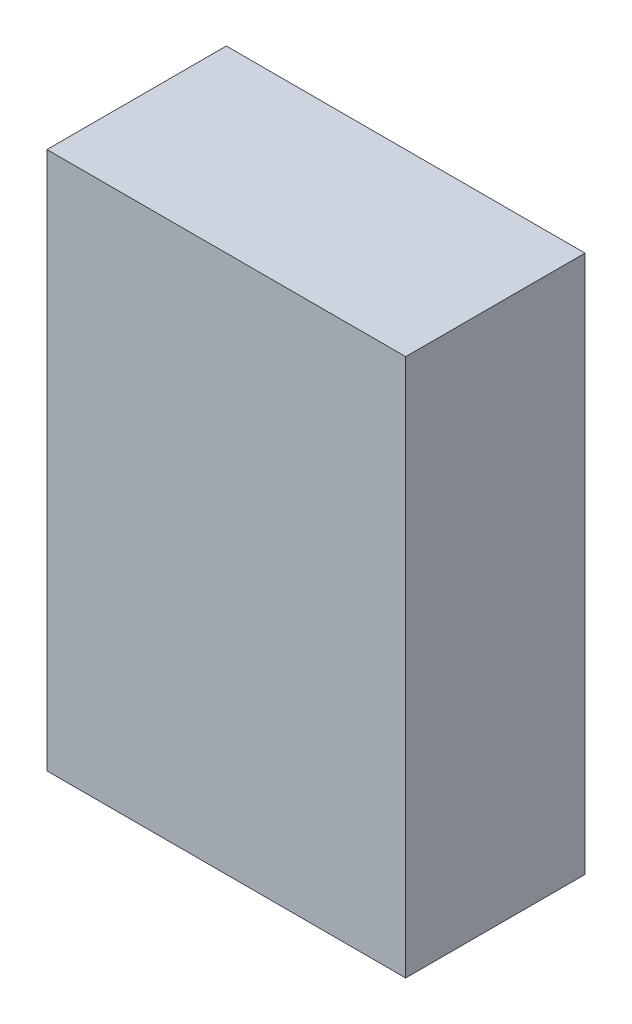
ISO-10303-21;
HEADER;
FILE_DESCRIPTION(('STEP AP214'),'2;1');
FILE_NAME('part.step','',(''),(''),'','','');
FILE_SCHEMA(('AUTOMOTIVE_DESIGN { 1 0 10303 214 1 1 1 1 }'));
ENDSEC;
DATA;
#1=APPLICATION_CONTEXT('core data for automotive mechanical design processes');
#2=APPLICATION_PROTOCOL_DEFINITION('international standard','automotive_design',2000,#1);
#3=PRODUCT_CONTEXT('',#1,'mechanical');
#4=PRODUCT('Part','Part','',(#3));
#5=PRODUCT_RELATED_PRODUCT_CATEGORY('part','',(#4));
#6=PRODUCT_DEFINITION_FORMATION('','',#4);
#7=PRODUCT_DEFINITION_CONTEXT('part definition',#1,'design');
#8=PRODUCT_DEFINITION('design','',#6,#7);
#9=PRODUCT_DEFINITION_SHAPE('','',#8);
#10=(LENGTH_UNIT() NAMED_UNIT(*) SI_UNIT(.MILLI.,.METRE.));
#11=(NAMED_UNIT(*) PLANE_ANGLE_UNIT() SI_UNIT($,.RADIAN.));
#12=(NAMED_UNIT(*) SI_UNIT($,.STERADIAN.) SOLID_ANGLE_UNIT());
#13=UNCERTAINTY_MEASURE_WITH_UNIT(LENGTH_MEASURE(1.E-05),#10,'distance_accuracy_value','');
#14=(GEOMETRIC_REPRESENTATION_CONTEXT(3) GLOBAL_UNCERTAINTY_ASSIGNED_CONTEXT((#13)) GLOBAL_UNIT_ASSIGNED_CONTEXT((#10,
#11,#12)) REPRESENTATION_CONTEXT('',''));
#15=CARTESIAN_POINT('',(0.,0.,0.));
#16=DIRECTION('',(0.,0.,1.));
#17=DIRECTION('',(1.,0.,0.));
#18=AXIS2_PLACEMENT_3D('',#15,#16,#17);
#19=CARTESIAN_POINT('',(-4.20452074349104,9.92882539662953,-2.12));
#20=DIRECTION('',(0.,-1.,0.));
#21=DIRECTION('',(0.,0.,-1.));
#22=AXIS2_PLACEMENT_3D('',#19,#20,#21);
#23=PLANE('',#22);
#24=DIRECTION('',(1.,0.,0.));
#25=VECTOR('',#24,1.);
#26=CARTESIAN_POINT('',(-6.20452074349104,9.92882539662953,-2.12));
#27=LINE('',#26,#25);
#28=CARTESIAN_POINT('',(-6.20452074349104,9.92882539662953,-2.12));
#29=VERTEX_POINT('',#28);
#30=CARTESIAN_POINT('',(-4.20452074349104,9.92882539662953,-2.12));
#31=VERTEX_POINT('',#30);
#32=EDGE_CURVE('E26',#29,#31,#27,.T.);
#33=ORIENTED_EDGE('',*,*,#32,.F.);
#34=DIRECTION('',(0.,0.,-1.));
#35=VECTOR('',#34,1.);
#36=CARTESIAN_POINT('',(-6.20452074349104,9.92882539662953,-2.12));
#37=LINE('',#36,#35);
#38=CARTESIAN_POINT('',(-6.20452074349104,9.92882539662953,-3.12));
#39=VERTEX_POINT('',#38);
#40=EDGE_CURVE('E11',#29,#39,#37,.T.);
#41=ORIENTED_EDGE('',*,*,#40,.T.);
#42=DIRECTION('',(-1.,0.,0.));
#43=VECTOR('',#42,1.);
#44=CARTESIAN_POINT('',(-6.20452074349104,9.92882539662953,-3.12));
#45=LINE('',#44,#43);
#46=CARTESIAN_POINT('',(-4.20452074349104,9.92882539662953,-3.12));
#47=VERTEX_POINT('',#46);
#48=EDGE_CURVE('E107',#47,#39,#45,.T.);
#49=ORIENTED_EDGE('',*,*,#48,.F.);
#50=DIRECTION('',(0.,0.,-1.));
#51=VECTOR('',#50,1.);
#52=CARTESIAN_POINT('',(-4.20452074349104,9.92882539662953,-2.12));
#53=LINE('',#52,#51);
#54=EDGE_CURVE('E101',#31,#47,#53,.T.);
#55=ORIENTED_EDGE('',*,*,#54,.F.);
#56=EDGE_LOOP('',(#33,#41,#49,#55));
#57=FACE_BOUND('',#56,.T.);
#58=ADVANCED_FACE('F16',(#57),#23,.T.);
#59=CARTESIAN_POINT('',(-6.20452074349104,9.92882539662953,-2.12));
#60=DIRECTION('',(-1.,0.,0.));
#61=DIRECTION('',(0.,0.,1.));
#62=AXIS2_PLACEMENT_3D('',#59,#60,#61);
#63=PLANE('',#62);
#64=DIRECTION('',(0.,-1.,0.));
#65=VECTOR('',#64,1.);
#66=CARTESIAN_POINT('',(-6.20452074349104,12.9288253966295,-2.12));
#67=LINE('',#66,#65);
#68=CARTESIAN_POINT('',(-6.20452074349104,12.9288253966295,-2.12));
#69=VERTEX_POINT('',#68);
#70=EDGE_CURVE('E70',#69,#29,#67,.T.);
#71=ORIENTED_EDGE('',*,*,#70,.F.);
#72=DIRECTION('',(0.,0.,-1.));
#73=VECTOR('',#72,1.);
#74=CARTESIAN_POINT('',(-6.20452074349104,12.9288253966295,-2.12));
#75=LINE('',#74,#73);
#76=CARTESIAN_POINT('',(-6.20452074349104,12.9288253966295,-3.12));
#77=VERTEX_POINT('',#76);
#78=EDGE_CURVE('E73',#69,#77,#75,.T.);
#79=ORIENTED_EDGE('',*,*,#78,.T.);
#80=DIRECTION('',(0.,1.,0.));
#81=VECTOR('',#80,1.);
#82=CARTESIAN_POINT('',(-6.20452074349104,12.9288253966295,-3.12));
#83=LINE('',#82,#81);
#84=EDGE_CURVE('E76',#39,#77,#83,.T.);
#85=ORIENTED_EDGE('',*,*,#84,.F.);
#86=ORIENTED_EDGE('',*,*,#40,.F.);
#87=EDGE_LOOP('',(#71,#79,#85,#86));
#88=FACE_BOUND('',#87,.T.);
#89=ADVANCED_FACE('F72',(#88),#63,.T.);
#90=CARTESIAN_POINT('',(-5.20452074349104,11.4288253966295,-2.12));
#91=DIRECTION('',(0.,0.,-1.));
#92=DIRECTION('',(0.,-1.,0.));
#93=AXIS2_PLACEMENT_3D('',#90,#91,#92);
#94=PLANE('',#93);
#95=DIRECTION('',(-1.,0.,0.));
#96=VECTOR('',#95,1.);
#97=CARTESIAN_POINT('',(-4.20452074349104,12.9288253966295,-2.12));
#98=LINE('',#97,#96);
#99=CARTESIAN_POINT('',(-4.20452074349104,12.9288253966295,-2.12));
#100=VERTEX_POINT('',#99);
#101=EDGE_CURVE('E19',#100,#69,#98,.T.);
#102=ORIENTED_EDGE('',*,*,#101,.T.);
#103=ORIENTED_EDGE('',*,*,#70,.T.);
#104=ORIENTED_EDGE('',*,*,#32,.T.);
#105=DIRECTION('',(0.,1.,0.));
#106=VECTOR('',#105,1.);
#107=CARTESIAN_POINT('',(-4.20452074349104,9.92882539662953,-2.12));
#108=LINE('',#107,#106);
#109=EDGE_CURVE('E64',#31,#100,#108,.T.);
#110=ORIENTED_EDGE('',*,*,#109,.T.);
#111=EDGE_LOOP('',(#102,#103,#104,#110));
#112=FACE_BOUND('',#111,.T.);
#113=ADVANCED_FACE('F85',(#112),#94,.F.);
#114=CARTESIAN_POINT('',(-5.20452074349104,11.4288253966295,-3.12));
#115=DIRECTION('',(0.,0.,-1.));
#116=DIRECTION('',(0.,-1.,0.));
#117=AXIS2_PLACEMENT_3D('',#114,#115,#116);
#118=PLANE('',#117);
#119=DIRECTION('',(1.,0.,0.));
#120=VECTOR('',#119,1.);
#121=CARTESIAN_POINT('',(-4.20452074349104,12.9288253966295,-3.12));
#122=LINE('',#121,#120);
#123=CARTESIAN_POINT('',(-4.20452074349104,12.9288253966295,-3.12));
#124=VERTEX_POINT('',#123);
#125=EDGE_CURVE('E83',#77,#124,#122,.T.);
#126=ORIENTED_EDGE('',*,*,#125,.T.);
#127=DIRECTION('',(0.,-1.,0.));
#128=VECTOR('',#127,1.);
#129=CARTESIAN_POINT('',(-4.20452074349104,9.92882539662953,-3.12));
#130=LINE('',#129,#128);
#131=EDGE_CURVE('E104',#124,#47,#130,.T.);
#132=ORIENTED_EDGE('',*,*,#131,.T.);
#133=ORIENTED_EDGE('',*,*,#48,.T.);
#134=ORIENTED_EDGE('',*,*,#84,.T.);
#135=EDGE_LOOP('',(#126,#132,#133,#134));
#136=FACE_BOUND('',#135,.T.);
#137=ADVANCED_FACE('F195',(#136),#118,.T.);
#138=CARTESIAN_POINT('',(-4.20452074349104,12.9288253966295,-2.12));
#139=DIRECTION('',(1.,0.,0.));
#140=DIRECTION('',(0.,1.,0.));
#141=AXIS2_PLACEMENT_3D('',#138,#139,#140);
#142=PLANE('',#141);
#143=ORIENTED_EDGE('',*,*,#109,.F.);
#144=ORIENTED_EDGE('',*,*,#54,.T.);
#145=ORIENTED_EDGE('',*,*,#131,.F.);
#146=DIRECTION('',(0.,0.,-1.));
#147=VECTOR('',#146,1.);
#148=CARTESIAN_POINT('',(-4.20452074349104,12.9288253966295,-2.12));
#149=LINE('',#148,#147);
#150=EDGE_CURVE('E87',#100,#124,#149,.T.);
#151=ORIENTED_EDGE('',*,*,#150,.F.);
#152=EDGE_LOOP('',(#143,#144,#145,#151));
#153=FACE_BOUND('',#152,.T.);
#154=ADVANCED_FACE('F204',(#153),#142,.T.);
#155=CARTESIAN_POINT('',(-6.20452074349104,12.9288253966295,-2.12));
#156=DIRECTION('',(0.,1.,0.));
#157=DIRECTION('',(1.,0.,0.));
#158=AXIS2_PLACEMENT_3D('',#155,#156,#157);
#159=PLANE('',#158);
#160=ORIENTED_EDGE('',*,*,#101,.F.);
#161=ORIENTED_EDGE('',*,*,#150,.T.);
#162=ORIENTED_EDGE('',*,*,#125,.F.);
#163=ORIENTED_EDGE('',*,*,#78,.F.);
#164=EDGE_LOOP('',(#160,#161,#162,#163));
#165=FACE_BOUND('',#164,.T.);
#166=ADVANCED_FACE('F80',(#165),#159,.T.);
#167=CLOSED_SHELL('',(#58,#89,#113,#137,#154,#166));
#168=MANIFOLD_SOLID_BREP('B1',#167);
#169=ADVANCED_BREP_SHAPE_REPRESENTATION('',(#18,#168),#14);
#170=SHAPE_DEFINITION_REPRESENTATION(#9,#169);
ENDSEC;
END-ISO-10303-21;
